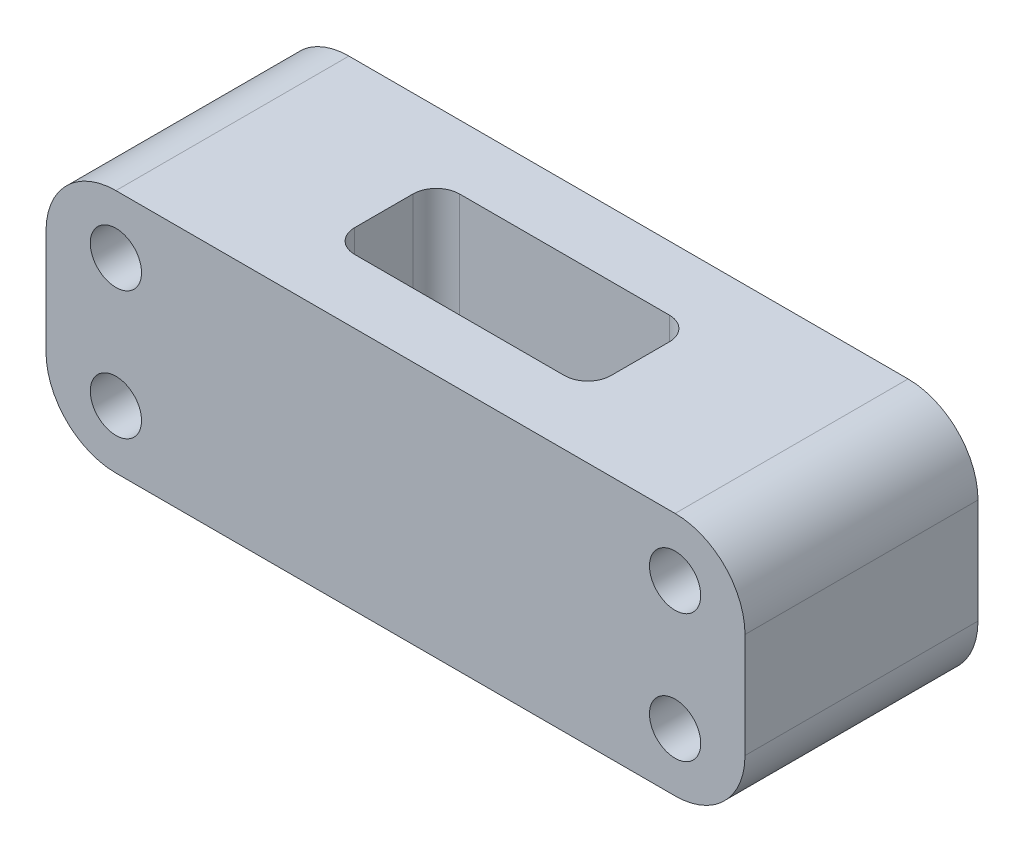
ISO-10303-21;
HEADER;
FILE_DESCRIPTION(('STEP AP214'),'2;1');
FILE_NAME('part.step','',(''),(''),'','','');
FILE_SCHEMA(('AUTOMOTIVE_DESIGN { 1 0 10303 214 1 1 1 1 }'));
ENDSEC;
DATA;
#1=APPLICATION_CONTEXT('core data for automotive mechanical design processes');
#2=APPLICATION_PROTOCOL_DEFINITION('international standard','automotive_design',2000,#1);
#3=PRODUCT_CONTEXT('',#1,'mechanical');
#4=PRODUCT('Part','Part','',(#3));
#5=PRODUCT_RELATED_PRODUCT_CATEGORY('part','',(#4));
#6=PRODUCT_DEFINITION_FORMATION('','',#4);
#7=PRODUCT_DEFINITION_CONTEXT('part definition',#1,'design');
#8=PRODUCT_DEFINITION('design','',#6,#7);
#9=PRODUCT_DEFINITION_SHAPE('','',#8);
#10=(LENGTH_UNIT() NAMED_UNIT(*) SI_UNIT(.MILLI.,.METRE.));
#11=(NAMED_UNIT(*) PLANE_ANGLE_UNIT() SI_UNIT($,.RADIAN.));
#12=(NAMED_UNIT(*) SI_UNIT($,.STERADIAN.) SOLID_ANGLE_UNIT());
#13=UNCERTAINTY_MEASURE_WITH_UNIT(LENGTH_MEASURE(1.E-05),#10,'distance_accuracy_value','');
#14=(GEOMETRIC_REPRESENTATION_CONTEXT(3) GLOBAL_UNCERTAINTY_ASSIGNED_CONTEXT((#13)) GLOBAL_UNIT_ASSIGNED_CONTEXT((#10,
#11,#12)) REPRESENTATION_CONTEXT('',''));
#15=CARTESIAN_POINT('',(0.,0.,0.));
#16=DIRECTION('',(0.,0.,1.));
#17=DIRECTION('',(1.,0.,0.));
#18=AXIS2_PLACEMENT_3D('',#15,#16,#17);
#19=CARTESIAN_POINT('',(30.,10.5,-10.));
#20=DIRECTION('',(1.,0.,0.));
#21=DIRECTION('',(0.,0.,-1.));
#22=AXIS2_PLACEMENT_3D('',#19,#20,#21);
#23=PLANE('',#22);
#24=DIRECTION('',(0.,1.,0.));
#25=VECTOR('',#24,1.);
#26=CARTESIAN_POINT('',(30.,10.5,10.));
#27=LINE('',#26,#25);
#28=CARTESIAN_POINT('',(30.,-4.5,10.));
#29=VERTEX_POINT('',#28);
#30=CARTESIAN_POINT('',(30.,4.5,10.));
#31=VERTEX_POINT('',#30);
#32=EDGE_CURVE('E240',#29,#31,#27,.T.);
#33=ORIENTED_EDGE('',*,*,#32,.F.);
#34=DIRECTION('',(0.,0.,1.));
#35=VECTOR('',#34,1.);
#36=CARTESIAN_POINT('',(30.,-4.5,-10.));
#37=LINE('',#36,#35);
#38=CARTESIAN_POINT('',(30.,-4.5,-10.));
#39=VERTEX_POINT('',#38);
#40=EDGE_CURVE('E282',#29,#39,#37,.F.);
#41=ORIENTED_EDGE('',*,*,#40,.T.);
#42=DIRECTION('',(0.,1.,0.));
#43=VECTOR('',#42,1.);
#44=CARTESIAN_POINT('',(30.,10.5,-10.));
#45=LINE('',#44,#43);
#46=CARTESIAN_POINT('',(30.,4.5,-10.));
#47=VERTEX_POINT('',#46);
#48=EDGE_CURVE('E254',#39,#47,#45,.T.);
#49=ORIENTED_EDGE('',*,*,#48,.T.);
#50=DIRECTION('',(0.,0.,1.));
#51=VECTOR('',#50,1.);
#52=CARTESIAN_POINT('',(30.,4.5,-10.));
#53=LINE('',#52,#51);
#54=EDGE_CURVE('E279',#47,#31,#53,.T.);
#55=ORIENTED_EDGE('',*,*,#54,.T.);
#56=EDGE_LOOP('',(#33,#41,#49,#55));
#57=FACE_BOUND('',#56,.T.);
#58=ADVANCED_FACE('F37',(#57),#23,.T.);
#59=CARTESIAN_POINT('',(-30.,-10.5,-10.));
#60=DIRECTION('',(0.,-1.,0.));
#61=DIRECTION('',(0.,0.,-1.));
#62=AXIS2_PLACEMENT_3D('',#59,#60,#61);
#63=PLANE('',#62);
#64=CARTESIAN_POINT('',(9.,-10.5,-2.5));
#65=DIRECTION('',(0.,1.,0.));
#66=DIRECTION('',(0.,0.,1.));
#67=AXIS2_PLACEMENT_3D('',#64,#65,#66);
#68=CIRCLE('',#67,2.);
#69=CARTESIAN_POINT('',(11.,-10.5,-2.5));
#70=VERTEX_POINT('',#69);
#71=CARTESIAN_POINT('',(9.,-10.5,-4.5));
#72=VERTEX_POINT('',#71);
#73=EDGE_CURVE('E152',#70,#72,#68,.T.);
#74=ORIENTED_EDGE('',*,*,#73,.T.);
#75=DIRECTION('',(-1.,0.,0.));
#76=VECTOR('',#75,1.);
#77=CARTESIAN_POINT('',(9.,-10.5,-4.5));
#78=LINE('',#77,#76);
#79=CARTESIAN_POINT('',(-9.,-10.5,-4.5));
#80=VERTEX_POINT('',#79);
#81=EDGE_CURVE('E161',#72,#80,#78,.T.);
#82=ORIENTED_EDGE('',*,*,#81,.T.);
#83=CARTESIAN_POINT('',(-9.,-10.5,-2.5));
#84=DIRECTION('',(0.,1.,0.));
#85=DIRECTION('',(0.,0.,1.));
#86=AXIS2_PLACEMENT_3D('',#83,#84,#85);
#87=CIRCLE('',#86,2.);
#88=CARTESIAN_POINT('',(-11.,-10.5,-2.5));
#89=VERTEX_POINT('',#88);
#90=EDGE_CURVE('E52',#80,#89,#87,.T.);
#91=ORIENTED_EDGE('',*,*,#90,.T.);
#92=DIRECTION('',(0.,0.,1.));
#93=VECTOR('',#92,1.);
#94=CARTESIAN_POINT('',(-11.,-10.5,2.5));
#95=LINE('',#94,#93);
#96=CARTESIAN_POINT('',(-11.,-10.5,2.5));
#97=VERTEX_POINT('',#96);
#98=EDGE_CURVE('E176',#89,#97,#95,.T.);
#99=ORIENTED_EDGE('',*,*,#98,.T.);
#100=CARTESIAN_POINT('',(-9.,-10.5,2.5));
#101=DIRECTION('',(0.,1.,0.));
#102=DIRECTION('',(0.,0.,-1.));
#103=AXIS2_PLACEMENT_3D('',#100,#101,#102);
#104=CIRCLE('',#103,2.);
#105=CARTESIAN_POINT('',(-9.,-10.5,4.5));
#106=VERTEX_POINT('',#105);
#107=EDGE_CURVE('E179',#97,#106,#104,.T.);
#108=ORIENTED_EDGE('',*,*,#107,.T.);
#109=DIRECTION('',(1.,0.,0.));
#110=VECTOR('',#109,1.);
#111=CARTESIAN_POINT('',(9.,-10.5,4.5));
#112=LINE('',#111,#110);
#113=CARTESIAN_POINT('',(9.,-10.5,4.5));
#114=VERTEX_POINT('',#113);
#115=EDGE_CURVE('E182',#106,#114,#112,.T.);
#116=ORIENTED_EDGE('',*,*,#115,.T.);
#117=CARTESIAN_POINT('',(9.,-10.5,2.5));
#118=DIRECTION('',(0.,1.,0.));
#119=DIRECTION('',(0.,0.,1.));
#120=AXIS2_PLACEMENT_3D('',#117,#118,#119);
#121=CIRCLE('',#120,2.);
#122=CARTESIAN_POINT('',(11.,-10.5,2.5));
#123=VERTEX_POINT('',#122);
#124=EDGE_CURVE('E185',#114,#123,#121,.T.);
#125=ORIENTED_EDGE('',*,*,#124,.T.);
#126=DIRECTION('',(0.,0.,-1.));
#127=VECTOR('',#126,1.);
#128=CARTESIAN_POINT('',(11.,-10.5,2.5));
#129=LINE('',#128,#127);
#130=EDGE_CURVE('E158',#123,#70,#129,.T.);
#131=ORIENTED_EDGE('',*,*,#130,.T.);
#132=EDGE_LOOP('',(#74,#82,#91,#99,#108,#116,#125,#131));
#133=FACE_BOUND('',#132,.T.);
#134=DIRECTION('',(1.,0.,0.));
#135=VECTOR('',#134,1.);
#136=CARTESIAN_POINT('',(-30.,-10.5,-10.));
#137=LINE('',#136,#135);
#138=CARTESIAN_POINT('',(-24.,-10.5,-10.));
#139=VERTEX_POINT('',#138);
#140=CARTESIAN_POINT('',(24.,-10.5,-10.));
#141=VERTEX_POINT('',#140);
#142=EDGE_CURVE('E263',#139,#141,#137,.T.);
#143=ORIENTED_EDGE('',*,*,#142,.T.);
#144=DIRECTION('',(0.,0.,1.));
#145=VECTOR('',#144,1.);
#146=CARTESIAN_POINT('',(24.,-10.5,-10.));
#147=LINE('',#146,#145);
#148=CARTESIAN_POINT('',(24.,-10.5,10.));
#149=VERTEX_POINT('',#148);
#150=EDGE_CURVE('E268',#141,#149,#147,.T.);
#151=ORIENTED_EDGE('',*,*,#150,.T.);
#152=DIRECTION('',(1.,0.,0.));
#153=VECTOR('',#152,1.);
#154=CARTESIAN_POINT('',(-30.,-10.5,10.));
#155=LINE('',#154,#153);
#156=CARTESIAN_POINT('',(-24.,-10.5,10.));
#157=VERTEX_POINT('',#156);
#158=EDGE_CURVE('E251',#157,#149,#155,.T.);
#159=ORIENTED_EDGE('',*,*,#158,.F.);
#160=DIRECTION('',(0.,0.,1.));
#161=VECTOR('',#160,1.);
#162=CARTESIAN_POINT('',(-24.,-10.5,-10.));
#163=LINE('',#162,#161);
#164=EDGE_CURVE('E266',#157,#139,#163,.F.);
#165=ORIENTED_EDGE('',*,*,#164,.T.);
#166=EDGE_LOOP('',(#143,#151,#159,#165));
#167=FACE_BOUND('',#166,.T.);
#168=ADVANCED_FACE('F165',(#133,#167),#63,.T.);
#169=CARTESIAN_POINT('',(-30.,10.5,-10.));
#170=DIRECTION('',(-1.,0.,0.));
#171=DIRECTION('',(0.,0.,1.));
#172=AXIS2_PLACEMENT_3D('',#169,#170,#171);
#173=PLANE('',#172);
#174=DIRECTION('',(0.,-1.,0.));
#175=VECTOR('',#174,1.);
#176=CARTESIAN_POINT('',(-30.,10.5,-10.));
#177=LINE('',#176,#175);
#178=CARTESIAN_POINT('',(-30.,4.5,-10.));
#179=VERTEX_POINT('',#178);
#180=CARTESIAN_POINT('',(-30.,-4.5,-10.));
#181=VERTEX_POINT('',#180);
#182=EDGE_CURVE('E260',#179,#181,#177,.T.);
#183=ORIENTED_EDGE('',*,*,#182,.T.);
#184=DIRECTION('',(0.,0.,1.));
#185=VECTOR('',#184,1.);
#186=CARTESIAN_POINT('',(-30.,-4.5,-10.));
#187=LINE('',#186,#185);
#188=CARTESIAN_POINT('',(-30.,-4.5,10.));
#189=VERTEX_POINT('',#188);
#190=EDGE_CURVE('E11',#181,#189,#187,.T.);
#191=ORIENTED_EDGE('',*,*,#190,.T.);
#192=DIRECTION('',(0.,-1.,0.));
#193=VECTOR('',#192,1.);
#194=CARTESIAN_POINT('',(-30.,10.5,10.));
#195=LINE('',#194,#193);
#196=CARTESIAN_POINT('',(-30.,4.5,10.));
#197=VERTEX_POINT('',#196);
#198=EDGE_CURVE('E248',#197,#189,#195,.T.);
#199=ORIENTED_EDGE('',*,*,#198,.F.);
#200=DIRECTION('',(0.,0.,1.));
#201=VECTOR('',#200,1.);
#202=CARTESIAN_POINT('',(-30.,4.5,-10.));
#203=LINE('',#202,#201);
#204=EDGE_CURVE('E45',#197,#179,#203,.F.);
#205=ORIENTED_EDGE('',*,*,#204,.T.);
#206=EDGE_LOOP('',(#183,#191,#199,#205));
#207=FACE_BOUND('',#206,.T.);
#208=ADVANCED_FACE('F300',(#207),#173,.T.);
#209=CARTESIAN_POINT('',(-30.,10.5,-10.));
#210=DIRECTION('',(0.,1.,0.));
#211=DIRECTION('',(0.,0.,1.));
#212=AXIS2_PLACEMENT_3D('',#209,#210,#211);
#213=PLANE('',#212);
#214=CARTESIAN_POINT('',(9.,10.5,-2.5));
#215=DIRECTION('',(0.,1.,0.));
#216=DIRECTION('',(0.,0.,1.));
#217=AXIS2_PLACEMENT_3D('',#214,#215,#216);
#218=CIRCLE('',#217,2.);
#219=CARTESIAN_POINT('',(11.,10.5,-2.5));
#220=VERTEX_POINT('',#219);
#221=CARTESIAN_POINT('',(8.99999999999999,10.5,-4.5));
#222=VERTEX_POINT('',#221);
#223=EDGE_CURVE('E60',#220,#222,#218,.T.);
#224=ORIENTED_EDGE('',*,*,#223,.F.);
#225=DIRECTION('',(0.,0.,-1.));
#226=VECTOR('',#225,1.);
#227=CARTESIAN_POINT('',(11.,10.5,2.5));
#228=LINE('',#227,#226);
#229=CARTESIAN_POINT('',(11.,10.5,2.5));
#230=VERTEX_POINT('',#229);
#231=EDGE_CURVE('E169',#230,#220,#228,.T.);
#232=ORIENTED_EDGE('',*,*,#231,.F.);
#233=CARTESIAN_POINT('',(9.,10.5,2.5));
#234=DIRECTION('',(0.,1.,0.));
#235=DIRECTION('',(0.,0.,1.));
#236=AXIS2_PLACEMENT_3D('',#233,#234,#235);
#237=CIRCLE('',#236,2.);
#238=CARTESIAN_POINT('',(9.,10.5,4.5));
#239=VERTEX_POINT('',#238);
#240=EDGE_CURVE('E172',#239,#230,#237,.T.);
#241=ORIENTED_EDGE('',*,*,#240,.F.);
#242=DIRECTION('',(1.,0.,0.));
#243=VECTOR('',#242,1.);
#244=CARTESIAN_POINT('',(9.,10.5,4.5));
#245=LINE('',#244,#243);
#246=CARTESIAN_POINT('',(-9.,10.5,4.5));
#247=VERTEX_POINT('',#246);
#248=EDGE_CURVE('E200',#247,#239,#245,.T.);
#249=ORIENTED_EDGE('',*,*,#248,.F.);
#250=CARTESIAN_POINT('',(-9.,10.5,2.5));
#251=DIRECTION('',(0.,1.,0.));
#252=DIRECTION('',(0.,0.,-1.));
#253=AXIS2_PLACEMENT_3D('',#250,#251,#252);
#254=CIRCLE('',#253,2.);
#255=CARTESIAN_POINT('',(-11.,10.5,2.5));
#256=VERTEX_POINT('',#255);
#257=EDGE_CURVE('E197',#256,#247,#254,.T.);
#258=ORIENTED_EDGE('',*,*,#257,.F.);
#259=DIRECTION('',(0.,0.,1.));
#260=VECTOR('',#259,1.);
#261=CARTESIAN_POINT('',(-11.,10.5,2.5));
#262=LINE('',#261,#260);
#263=CARTESIAN_POINT('',(-11.,10.5,-2.5));
#264=VERTEX_POINT('',#263);
#265=EDGE_CURVE('E194',#264,#256,#262,.T.);
#266=ORIENTED_EDGE('',*,*,#265,.F.);
#267=CARTESIAN_POINT('',(-9.,10.5,-2.5));
#268=DIRECTION('',(0.,1.,0.));
#269=DIRECTION('',(0.,0.,1.));
#270=AXIS2_PLACEMENT_3D('',#267,#268,#269);
#271=CIRCLE('',#270,2.);
#272=CARTESIAN_POINT('',(-9.,10.5,-4.5));
#273=VERTEX_POINT('',#272);
#274=EDGE_CURVE('E191',#273,#264,#271,.T.);
#275=ORIENTED_EDGE('',*,*,#274,.F.);
#276=DIRECTION('',(-1.,0.,0.));
#277=VECTOR('',#276,1.);
#278=CARTESIAN_POINT('',(9.,10.5,-4.5));
#279=LINE('',#278,#277);
#280=EDGE_CURVE('E189',#222,#273,#279,.T.);
#281=ORIENTED_EDGE('',*,*,#280,.F.);
#282=EDGE_LOOP('',(#224,#232,#241,#249,#258,#266,#275,#281));
#283=FACE_BOUND('',#282,.T.);
#284=DIRECTION('',(-1.,0.,0.));
#285=VECTOR('',#284,1.);
#286=CARTESIAN_POINT('',(-30.,10.5,10.));
#287=LINE('',#286,#285);
#288=CARTESIAN_POINT('',(24.,10.5,10.));
#289=VERTEX_POINT('',#288);
#290=CARTESIAN_POINT('',(-24.,10.5,10.));
#291=VERTEX_POINT('',#290);
#292=EDGE_CURVE('E245',#289,#291,#287,.T.);
#293=ORIENTED_EDGE('',*,*,#292,.F.);
#294=DIRECTION('',(0.,0.,1.));
#295=VECTOR('',#294,1.);
#296=CARTESIAN_POINT('',(24.,10.5,-10.));
#297=LINE('',#296,#295);
#298=CARTESIAN_POINT('',(24.,10.5,-10.));
#299=VERTEX_POINT('',#298);
#300=EDGE_CURVE('E295',#289,#299,#297,.F.);
#301=ORIENTED_EDGE('',*,*,#300,.T.);
#302=DIRECTION('',(-1.,0.,0.));
#303=VECTOR('',#302,1.);
#304=CARTESIAN_POINT('',(-30.,10.5,-10.));
#305=LINE('',#304,#303);
#306=CARTESIAN_POINT('',(-24.,10.5,-10.));
#307=VERTEX_POINT('',#306);
#308=EDGE_CURVE('E257',#299,#307,#305,.T.);
#309=ORIENTED_EDGE('',*,*,#308,.T.);
#310=DIRECTION('',(0.,0.,1.));
#311=VECTOR('',#310,1.);
#312=CARTESIAN_POINT('',(-24.,10.5,-10.));
#313=LINE('',#312,#311);
#314=EDGE_CURVE('E292',#307,#291,#313,.T.);
#315=ORIENTED_EDGE('',*,*,#314,.T.);
#316=EDGE_LOOP('',(#293,#301,#309,#315));
#317=FACE_BOUND('',#316,.T.);
#318=ADVANCED_FACE('F313',(#283,#317),#213,.T.);
#319=CARTESIAN_POINT('',(0.,0.,-10.));
#320=DIRECTION('',(0.,0.,1.));
#321=DIRECTION('',(1.,0.,0.));
#322=AXIS2_PLACEMENT_3D('',#319,#320,#321);
#323=PLANE('',#322);
#324=CARTESIAN_POINT('',(-24.,-5.5,-10.));
#325=DIRECTION('',(0.,0.,1.));
#326=DIRECTION('',(-1.,0.,0.));
#327=AXIS2_PLACEMENT_3D('',#324,#325,#326);
#328=CIRCLE('',#327,2.2);
#329=CARTESIAN_POINT('',(-26.2,-5.5,-10.));
#330=VERTEX_POINT('',#329);
#331=EDGE_CURVE('E207',#330,#330,#328,.T.);
#332=ORIENTED_EDGE('',*,*,#331,.T.);
#333=EDGE_LOOP('',(#332));
#334=FACE_BOUND('',#333,.T.);
#335=CARTESIAN_POINT('',(24.,-5.5,-10.));
#336=DIRECTION('',(0.,0.,1.));
#337=DIRECTION('',(-1.,0.,0.));
#338=AXIS2_PLACEMENT_3D('',#335,#336,#337);
#339=CIRCLE('',#338,2.2);
#340=CARTESIAN_POINT('',(21.8,-5.5,-10.));
#341=VERTEX_POINT('',#340);
#342=EDGE_CURVE('E229',#341,#341,#339,.T.);
#343=ORIENTED_EDGE('',*,*,#342,.T.);
#344=EDGE_LOOP('',(#343));
#345=FACE_BOUND('',#344,.T.);
#346=CARTESIAN_POINT('',(24.,5.50000000000001,-10.));
#347=DIRECTION('',(0.,0.,1.));
#348=DIRECTION('',(1.,0.,0.));
#349=AXIS2_PLACEMENT_3D('',#346,#347,#348);
#350=CIRCLE('',#349,2.2);
#351=CARTESIAN_POINT('',(26.2,5.50000000000001,-10.));
#352=VERTEX_POINT('',#351);
#353=EDGE_CURVE('E223',#352,#352,#350,.T.);
#354=ORIENTED_EDGE('',*,*,#353,.T.);
#355=EDGE_LOOP('',(#354));
#356=FACE_BOUND('',#355,.T.);
#357=CARTESIAN_POINT('',(-24.,5.50000000000001,-10.));
#358=DIRECTION('',(0.,0.,1.));
#359=DIRECTION('',(1.,0.,0.));
#360=AXIS2_PLACEMENT_3D('',#357,#358,#359);
#361=CIRCLE('',#360,2.2);
#362=CARTESIAN_POINT('',(-21.8,5.50000000000001,-10.));
#363=VERTEX_POINT('',#362);
#364=EDGE_CURVE('E237',#363,#363,#361,.T.);
#365=ORIENTED_EDGE('',*,*,#364,.T.);
#366=EDGE_LOOP('',(#365));
#367=FACE_BOUND('',#366,.T.);
#368=ORIENTED_EDGE('',*,*,#48,.F.);
#369=CARTESIAN_POINT('',(24.,-4.5,-10.));
#370=DIRECTION('',(0.,0.,1.));
#371=DIRECTION('',(1.,0.,0.));
#372=AXIS2_PLACEMENT_3D('',#369,#370,#371);
#373=CIRCLE('',#372,6.);
#374=EDGE_CURVE('E290',#39,#141,#373,.F.);
#375=ORIENTED_EDGE('',*,*,#374,.T.);
#376=ORIENTED_EDGE('',*,*,#142,.F.);
#377=CARTESIAN_POINT('',(-24.,-4.5,-10.));
#378=DIRECTION('',(0.,0.,1.));
#379=DIRECTION('',(1.,0.,0.));
#380=AXIS2_PLACEMENT_3D('',#377,#378,#379);
#381=CIRCLE('',#380,6.);
#382=EDGE_CURVE('E286',#139,#181,#381,.F.);
#383=ORIENTED_EDGE('',*,*,#382,.T.);
#384=ORIENTED_EDGE('',*,*,#182,.F.);
#385=CARTESIAN_POINT('',(-24.,4.5,-10.));
#386=DIRECTION('',(0.,0.,1.));
#387=DIRECTION('',(1.,0.,0.));
#388=AXIS2_PLACEMENT_3D('',#385,#386,#387);
#389=CIRCLE('',#388,6.);
#390=EDGE_CURVE('E284',#179,#307,#389,.F.);
#391=ORIENTED_EDGE('',*,*,#390,.T.);
#392=ORIENTED_EDGE('',*,*,#308,.F.);
#393=CARTESIAN_POINT('',(24.,4.5,-10.));
#394=DIRECTION('',(0.,0.,1.));
#395=DIRECTION('',(1.,0.,0.));
#396=AXIS2_PLACEMENT_3D('',#393,#394,#395);
#397=CIRCLE('',#396,6.);
#398=EDGE_CURVE('E288',#299,#47,#397,.F.);
#399=ORIENTED_EDGE('',*,*,#398,.T.);
#400=EDGE_LOOP('',(#368,#375,#376,#383,#384,#391,#392,#399));
#401=FACE_BOUND('',#400,.T.);
#402=ADVANCED_FACE('F306',(#334,#345,#356,#367,#401),#323,.F.);
#403=CARTESIAN_POINT('',(0.,0.,10.));
#404=DIRECTION('',(0.,0.,1.));
#405=DIRECTION('',(1.,0.,0.));
#406=AXIS2_PLACEMENT_3D('',#403,#404,#405);
#407=PLANE('',#406);
#408=CARTESIAN_POINT('',(-24.,-5.5,10.));
#409=DIRECTION('',(0.,0.,1.));
#410=DIRECTION('',(-1.,0.,0.));
#411=AXIS2_PLACEMENT_3D('',#408,#409,#410);
#412=CIRCLE('',#411,2.2);
#413=CARTESIAN_POINT('',(-26.2,-5.5,10.));
#414=VERTEX_POINT('',#413);
#415=EDGE_CURVE('E232',#414,#414,#412,.T.);
#416=ORIENTED_EDGE('',*,*,#415,.F.);
#417=EDGE_LOOP('',(#416));
#418=FACE_BOUND('',#417,.T.);
#419=CARTESIAN_POINT('',(24.,-5.5,10.));
#420=DIRECTION('',(0.,0.,1.));
#421=DIRECTION('',(-1.,0.,0.));
#422=AXIS2_PLACEMENT_3D('',#419,#420,#421);
#423=CIRCLE('',#422,2.2);
#424=CARTESIAN_POINT('',(21.8,-5.5,10.));
#425=VERTEX_POINT('',#424);
#426=EDGE_CURVE('E226',#425,#425,#423,.T.);
#427=ORIENTED_EDGE('',*,*,#426,.F.);
#428=EDGE_LOOP('',(#427));
#429=FACE_BOUND('',#428,.T.);
#430=CARTESIAN_POINT('',(24.,5.50000000000001,10.));
#431=DIRECTION('',(0.,0.,1.));
#432=DIRECTION('',(1.,0.,0.));
#433=AXIS2_PLACEMENT_3D('',#430,#431,#432);
#434=CIRCLE('',#433,2.2);
#435=CARTESIAN_POINT('',(26.2,5.50000000000001,10.));
#436=VERTEX_POINT('',#435);
#437=EDGE_CURVE('E219',#436,#436,#434,.T.);
#438=ORIENTED_EDGE('',*,*,#437,.F.);
#439=EDGE_LOOP('',(#438));
#440=FACE_BOUND('',#439,.T.);
#441=CARTESIAN_POINT('',(-24.,5.50000000000001,10.));
#442=DIRECTION('',(0.,0.,1.));
#443=DIRECTION('',(1.,0.,0.));
#444=AXIS2_PLACEMENT_3D('',#441,#442,#443);
#445=CIRCLE('',#444,2.2);
#446=CARTESIAN_POINT('',(-21.8,5.50000000000001,10.));
#447=VERTEX_POINT('',#446);
#448=EDGE_CURVE('E222',#447,#447,#445,.T.);
#449=ORIENTED_EDGE('',*,*,#448,.F.);
#450=EDGE_LOOP('',(#449));
#451=FACE_BOUND('',#450,.T.);
#452=ORIENTED_EDGE('',*,*,#158,.T.);
#453=CARTESIAN_POINT('',(24.,-4.5,10.));
#454=DIRECTION('',(0.,0.,1.));
#455=DIRECTION('',(1.,0.,0.));
#456=AXIS2_PLACEMENT_3D('',#453,#454,#455);
#457=CIRCLE('',#456,6.);
#458=EDGE_CURVE('E277',#149,#29,#457,.T.);
#459=ORIENTED_EDGE('',*,*,#458,.T.);
#460=ORIENTED_EDGE('',*,*,#32,.T.);
#461=CARTESIAN_POINT('',(24.,4.5,10.));
#462=DIRECTION('',(0.,0.,1.));
#463=DIRECTION('',(1.,0.,0.));
#464=AXIS2_PLACEMENT_3D('',#461,#462,#463);
#465=CIRCLE('',#464,6.);
#466=EDGE_CURVE('E275',#31,#289,#465,.T.);
#467=ORIENTED_EDGE('',*,*,#466,.T.);
#468=ORIENTED_EDGE('',*,*,#292,.T.);
#469=CARTESIAN_POINT('',(-24.,4.5,10.));
#470=DIRECTION('',(0.,0.,1.));
#471=DIRECTION('',(1.,0.,0.));
#472=AXIS2_PLACEMENT_3D('',#469,#470,#471);
#473=CIRCLE('',#472,6.);
#474=EDGE_CURVE('E271',#291,#197,#473,.T.);
#475=ORIENTED_EDGE('',*,*,#474,.T.);
#476=ORIENTED_EDGE('',*,*,#198,.T.);
#477=CARTESIAN_POINT('',(-24.,-4.5,10.));
#478=DIRECTION('',(0.,0.,1.));
#479=DIRECTION('',(1.,0.,0.));
#480=AXIS2_PLACEMENT_3D('',#477,#478,#479);
#481=CIRCLE('',#480,6.);
#482=EDGE_CURVE('E273',#189,#157,#481,.T.);
#483=ORIENTED_EDGE('',*,*,#482,.T.);
#484=EDGE_LOOP('',(#452,#459,#460,#467,#468,#475,#476,#483));
#485=FACE_BOUND('',#484,.T.);
#486=ADVANCED_FACE('F316',(#418,#429,#440,#451,#485),#407,.T.);
#487=CARTESIAN_POINT('',(24.,-4.5,-10.));
#488=DIRECTION('',(0.,0.,1.));
#489=DIRECTION('',(1.,0.,0.));
#490=AXIS2_PLACEMENT_3D('',#487,#488,#489);
#491=CYLINDRICAL_SURFACE('',#490,6.);
#492=ORIENTED_EDGE('',*,*,#374,.F.);
#493=ORIENTED_EDGE('',*,*,#40,.F.);
#494=ORIENTED_EDGE('',*,*,#458,.F.);
#495=ORIENTED_EDGE('',*,*,#150,.F.);
#496=EDGE_LOOP('',(#492,#493,#494,#495));
#497=FACE_BOUND('',#496,.T.);
#498=ADVANCED_FACE('F327',(#497),#491,.T.);
#499=CARTESIAN_POINT('',(24.,4.5,-10.));
#500=DIRECTION('',(0.,0.,1.));
#501=DIRECTION('',(1.,0.,0.));
#502=AXIS2_PLACEMENT_3D('',#499,#500,#501);
#503=CYLINDRICAL_SURFACE('',#502,6.);
#504=ORIENTED_EDGE('',*,*,#398,.F.);
#505=ORIENTED_EDGE('',*,*,#300,.F.);
#506=ORIENTED_EDGE('',*,*,#466,.F.);
#507=ORIENTED_EDGE('',*,*,#54,.F.);
#508=EDGE_LOOP('',(#504,#505,#506,#507));
#509=FACE_BOUND('',#508,.T.);
#510=ADVANCED_FACE('F321',(#509),#503,.T.);
#511=CARTESIAN_POINT('',(-24.,-4.5,-10.));
#512=DIRECTION('',(0.,0.,1.));
#513=DIRECTION('',(1.,0.,0.));
#514=AXIS2_PLACEMENT_3D('',#511,#512,#513);
#515=CYLINDRICAL_SURFACE('',#514,6.);
#516=ORIENTED_EDGE('',*,*,#382,.F.);
#517=ORIENTED_EDGE('',*,*,#164,.F.);
#518=ORIENTED_EDGE('',*,*,#482,.F.);
#519=ORIENTED_EDGE('',*,*,#190,.F.);
#520=EDGE_LOOP('',(#516,#517,#518,#519));
#521=FACE_BOUND('',#520,.T.);
#522=ADVANCED_FACE('F331',(#521),#515,.T.);
#523=CARTESIAN_POINT('',(-24.,4.5,-10.));
#524=DIRECTION('',(0.,0.,1.));
#525=DIRECTION('',(1.,0.,0.));
#526=AXIS2_PLACEMENT_3D('',#523,#524,#525);
#527=CYLINDRICAL_SURFACE('',#526,6.);
#528=ORIENTED_EDGE('',*,*,#390,.F.);
#529=ORIENTED_EDGE('',*,*,#204,.F.);
#530=ORIENTED_EDGE('',*,*,#474,.F.);
#531=ORIENTED_EDGE('',*,*,#314,.F.);
#532=EDGE_LOOP('',(#528,#529,#530,#531));
#533=FACE_BOUND('',#532,.T.);
#534=ADVANCED_FACE('F39',(#533),#527,.T.);
#535=CARTESIAN_POINT('',(-24.,5.50000000000001,-10.));
#536=DIRECTION('',(0.,0.,1.));
#537=DIRECTION('',(1.,0.,0.));
#538=AXIS2_PLACEMENT_3D('',#535,#536,#537);
#539=CYLINDRICAL_SURFACE('',#538,2.2);
#540=ORIENTED_EDGE('',*,*,#364,.F.);
#541=EDGE_LOOP('',(#540));
#542=FACE_BOUND('',#541,.T.);
#543=ORIENTED_EDGE('',*,*,#448,.T.);
#544=EDGE_LOOP('',(#543));
#545=FACE_BOUND('',#544,.T.);
#546=ADVANCED_FACE('F337',(#542,#545),#539,.F.);
#547=CARTESIAN_POINT('',(24.,5.50000000000001,-10.));
#548=DIRECTION('',(0.,0.,1.));
#549=DIRECTION('',(1.,0.,0.));
#550=AXIS2_PLACEMENT_3D('',#547,#548,#549);
#551=CYLINDRICAL_SURFACE('',#550,2.2);
#552=ORIENTED_EDGE('',*,*,#353,.F.);
#553=EDGE_LOOP('',(#552));
#554=FACE_BOUND('',#553,.T.);
#555=ORIENTED_EDGE('',*,*,#437,.T.);
#556=EDGE_LOOP('',(#555));
#557=FACE_BOUND('',#556,.T.);
#558=ADVANCED_FACE('F413',(#554,#557),#551,.F.);
#559=CARTESIAN_POINT('',(24.,-5.5,-10.));
#560=DIRECTION('',(0.,0.,1.));
#561=DIRECTION('',(1.,0.,0.));
#562=AXIS2_PLACEMENT_3D('',#559,#560,#561);
#563=CYLINDRICAL_SURFACE('',#562,2.2);
#564=ORIENTED_EDGE('',*,*,#342,.F.);
#565=EDGE_LOOP('',(#564));
#566=FACE_BOUND('',#565,.T.);
#567=ORIENTED_EDGE('',*,*,#426,.T.);
#568=EDGE_LOOP('',(#567));
#569=FACE_BOUND('',#568,.T.);
#570=ADVANCED_FACE('F416',(#566,#569),#563,.F.);
#571=CARTESIAN_POINT('',(-24.,-5.5,-10.));
#572=DIRECTION('',(0.,0.,1.));
#573=DIRECTION('',(1.,0.,0.));
#574=AXIS2_PLACEMENT_3D('',#571,#572,#573);
#575=CYLINDRICAL_SURFACE('',#574,2.2);
#576=ORIENTED_EDGE('',*,*,#331,.F.);
#577=EDGE_LOOP('',(#576));
#578=FACE_BOUND('',#577,.T.);
#579=ORIENTED_EDGE('',*,*,#415,.T.);
#580=EDGE_LOOP('',(#579));
#581=FACE_BOUND('',#580,.T.);
#582=ADVANCED_FACE('F400',(#578,#581),#575,.F.);
#583=CARTESIAN_POINT('',(9.,-10.5,-2.5));
#584=DIRECTION('',(0.,1.,0.));
#585=DIRECTION('',(0.,0.,1.));
#586=AXIS2_PLACEMENT_3D('',#583,#584,#585);
#587=CYLINDRICAL_SURFACE('',#586,2.);
#588=ORIENTED_EDGE('',*,*,#223,.T.);
#589=DIRECTION('',(0.,1.,0.));
#590=VECTOR('',#589,1.);
#591=CARTESIAN_POINT('',(9.,-10.5,-4.5));
#592=LINE('',#591,#590);
#593=EDGE_CURVE('E148',#72,#222,#592,.T.);
#594=ORIENTED_EDGE('',*,*,#593,.F.);
#595=ORIENTED_EDGE('',*,*,#73,.F.);
#596=DIRECTION('',(0.,1.,0.));
#597=VECTOR('',#596,1.);
#598=CARTESIAN_POINT('',(11.,-10.5,-2.5));
#599=LINE('',#598,#597);
#600=EDGE_CURVE('E205',#70,#220,#599,.T.);
#601=ORIENTED_EDGE('',*,*,#600,.T.);
#602=EDGE_LOOP('',(#588,#594,#595,#601));
#603=FACE_BOUND('',#602,.T.);
#604=ADVANCED_FACE('F150',(#603),#587,.F.);
#605=CARTESIAN_POINT('',(11.,-10.5,2.5));
#606=DIRECTION('',(1.,0.,0.));
#607=DIRECTION('',(0.,0.,-1.));
#608=AXIS2_PLACEMENT_3D('',#605,#606,#607);
#609=PLANE('',#608);
#610=ORIENTED_EDGE('',*,*,#231,.T.);
#611=ORIENTED_EDGE('',*,*,#600,.F.);
#612=ORIENTED_EDGE('',*,*,#130,.F.);
#613=DIRECTION('',(0.,1.,0.));
#614=VECTOR('',#613,1.);
#615=CARTESIAN_POINT('',(11.,-10.5,2.5));
#616=LINE('',#615,#614);
#617=EDGE_CURVE('E208',#123,#230,#616,.T.);
#618=ORIENTED_EDGE('',*,*,#617,.T.);
#619=EDGE_LOOP('',(#610,#611,#612,#618));
#620=FACE_BOUND('',#619,.T.);
#621=ADVANCED_FACE('F392',(#620),#609,.F.);
#622=CARTESIAN_POINT('',(9.,-10.5,2.5));
#623=DIRECTION('',(0.,1.,0.));
#624=DIRECTION('',(0.,0.,1.));
#625=AXIS2_PLACEMENT_3D('',#622,#623,#624);
#626=CYLINDRICAL_SURFACE('',#625,2.);
#627=ORIENTED_EDGE('',*,*,#240,.T.);
#628=ORIENTED_EDGE('',*,*,#617,.F.);
#629=ORIENTED_EDGE('',*,*,#124,.F.);
#630=DIRECTION('',(0.,1.,0.));
#631=VECTOR('',#630,1.);
#632=CARTESIAN_POINT('',(9.,-10.5,4.5));
#633=LINE('',#632,#631);
#634=EDGE_CURVE('E210',#114,#239,#633,.T.);
#635=ORIENTED_EDGE('',*,*,#634,.T.);
#636=EDGE_LOOP('',(#627,#628,#629,#635));
#637=FACE_BOUND('',#636,.T.);
#638=ADVANCED_FACE('F390',(#637),#626,.F.);
#639=CARTESIAN_POINT('',(9.,-10.5,4.5));
#640=DIRECTION('',(0.,0.,1.));
#641=DIRECTION('',(1.,0.,0.));
#642=AXIS2_PLACEMENT_3D('',#639,#640,#641);
#643=PLANE('',#642);
#644=ORIENTED_EDGE('',*,*,#248,.T.);
#645=ORIENTED_EDGE('',*,*,#634,.F.);
#646=ORIENTED_EDGE('',*,*,#115,.F.);
#647=DIRECTION('',(0.,1.,0.));
#648=VECTOR('',#647,1.);
#649=CARTESIAN_POINT('',(-9.,-10.5,4.5));
#650=LINE('',#649,#648);
#651=EDGE_CURVE('E212',#106,#247,#650,.T.);
#652=ORIENTED_EDGE('',*,*,#651,.T.);
#653=EDGE_LOOP('',(#644,#645,#646,#652));
#654=FACE_BOUND('',#653,.T.);
#655=ADVANCED_FACE('F387',(#654),#643,.F.);
#656=CARTESIAN_POINT('',(-9.,-10.5,2.5));
#657=DIRECTION('',(0.,1.,0.));
#658=DIRECTION('',(0.,0.,1.));
#659=AXIS2_PLACEMENT_3D('',#656,#657,#658);
#660=CYLINDRICAL_SURFACE('',#659,2.);
#661=ORIENTED_EDGE('',*,*,#257,.T.);
#662=ORIENTED_EDGE('',*,*,#651,.F.);
#663=ORIENTED_EDGE('',*,*,#107,.F.);
#664=DIRECTION('',(0.,1.,0.));
#665=VECTOR('',#664,1.);
#666=CARTESIAN_POINT('',(-11.,-10.5,2.5));
#667=LINE('',#666,#665);
#668=EDGE_CURVE('E214',#97,#256,#667,.T.);
#669=ORIENTED_EDGE('',*,*,#668,.T.);
#670=EDGE_LOOP('',(#661,#662,#663,#669));
#671=FACE_BOUND('',#670,.T.);
#672=ADVANCED_FACE('F384',(#671),#660,.F.);
#673=CARTESIAN_POINT('',(-11.,-10.5,2.5));
#674=DIRECTION('',(-1.,0.,0.));
#675=DIRECTION('',(0.,0.,1.));
#676=AXIS2_PLACEMENT_3D('',#673,#674,#675);
#677=PLANE('',#676);
#678=ORIENTED_EDGE('',*,*,#265,.T.);
#679=ORIENTED_EDGE('',*,*,#668,.F.);
#680=ORIENTED_EDGE('',*,*,#98,.F.);
#681=DIRECTION('',(0.,1.,0.));
#682=VECTOR('',#681,1.);
#683=CARTESIAN_POINT('',(-11.,-10.5,-2.5));
#684=LINE('',#683,#682);
#685=EDGE_CURVE('E216',#89,#264,#684,.T.);
#686=ORIENTED_EDGE('',*,*,#685,.T.);
#687=EDGE_LOOP('',(#678,#679,#680,#686));
#688=FACE_BOUND('',#687,.T.);
#689=ADVANCED_FACE('F380',(#688),#677,.F.);
#690=CARTESIAN_POINT('',(-9.,-10.5,-2.5));
#691=DIRECTION('',(0.,1.,0.));
#692=DIRECTION('',(0.,0.,1.));
#693=AXIS2_PLACEMENT_3D('',#690,#691,#692);
#694=CYLINDRICAL_SURFACE('',#693,2.);
#695=ORIENTED_EDGE('',*,*,#274,.T.);
#696=ORIENTED_EDGE('',*,*,#685,.F.);
#697=ORIENTED_EDGE('',*,*,#90,.F.);
#698=DIRECTION('',(0.,1.,0.));
#699=VECTOR('',#698,1.);
#700=CARTESIAN_POINT('',(-9.,-10.5,-4.5));
#701=LINE('',#700,#699);
#702=EDGE_CURVE('E157',#80,#273,#701,.T.);
#703=ORIENTED_EDGE('',*,*,#702,.T.);
#704=EDGE_LOOP('',(#695,#696,#697,#703));
#705=FACE_BOUND('',#704,.T.);
#706=ADVANCED_FACE('F377',(#705),#694,.F.);
#707=CARTESIAN_POINT('',(9.,-10.5,-4.5));
#708=DIRECTION('',(0.,0.,-1.));
#709=DIRECTION('',(-1.,0.,0.));
#710=AXIS2_PLACEMENT_3D('',#707,#708,#709);
#711=PLANE('',#710);
#712=ORIENTED_EDGE('',*,*,#280,.T.);
#713=ORIENTED_EDGE('',*,*,#702,.F.);
#714=ORIENTED_EDGE('',*,*,#81,.F.);
#715=ORIENTED_EDGE('',*,*,#593,.T.);
#716=EDGE_LOOP('',(#712,#713,#714,#715));
#717=FACE_BOUND('',#716,.T.);
#718=ADVANCED_FACE('F162',(#717),#711,.F.);
#719=CLOSED_SHELL('',(#58,#168,#208,#318,#402,#486,#498,#510,#522,#534,#546,#558,#570,#582,#604,
#621,#638,#655,#672,#689,#706,#718));
#720=MANIFOLD_SOLID_BREP('B2',#719);
#721=ADVANCED_BREP_SHAPE_REPRESENTATION('',(#18,#720),#14);
#722=SHAPE_DEFINITION_REPRESENTATION(#9,#721);
ENDSEC;
END-ISO-10303-21;
